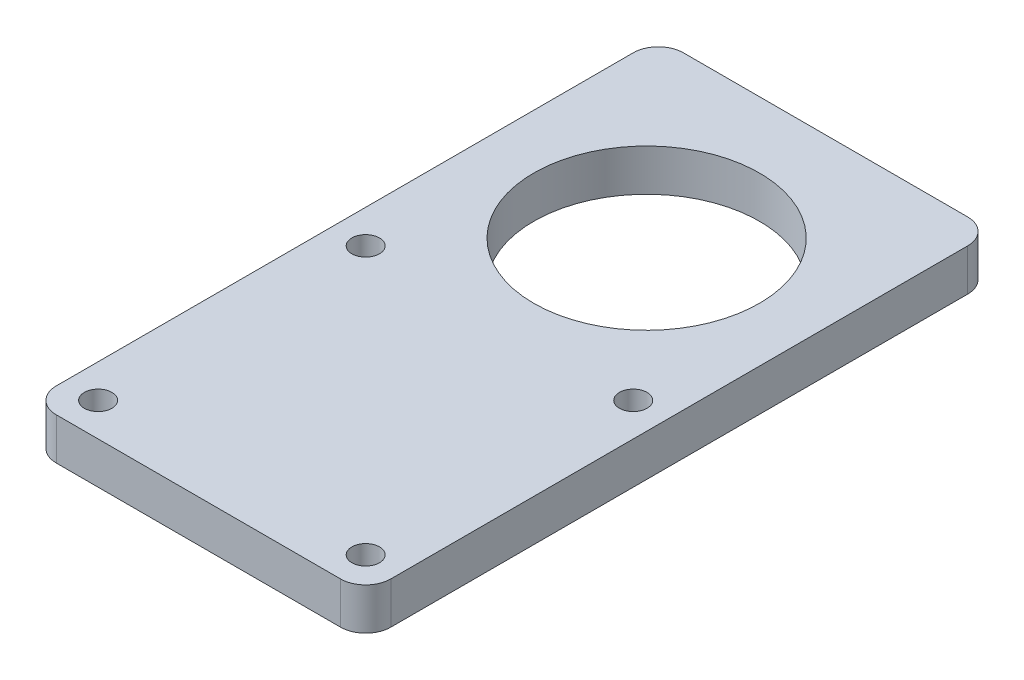
ISO-10303-21;
HEADER;
FILE_DESCRIPTION(('STEP AP214'),'2;1');
FILE_NAME('part.step','',(''),(''),'','','');
FILE_SCHEMA(('AUTOMOTIVE_DESIGN { 1 0 10303 214 1 1 1 1 }'));
ENDSEC;
DATA;
#1=APPLICATION_CONTEXT('core data for automotive mechanical design processes');
#2=APPLICATION_PROTOCOL_DEFINITION('international standard','automotive_design',2000,#1);
#3=PRODUCT_CONTEXT('',#1,'mechanical');
#4=PRODUCT('Part','Part','',(#3));
#5=PRODUCT_RELATED_PRODUCT_CATEGORY('part','',(#4));
#6=PRODUCT_DEFINITION_FORMATION('','',#4);
#7=PRODUCT_DEFINITION_CONTEXT('part definition',#1,'design');
#8=PRODUCT_DEFINITION('design','',#6,#7);
#9=PRODUCT_DEFINITION_SHAPE('','',#8);
#10=(LENGTH_UNIT() NAMED_UNIT(*) SI_UNIT(.MILLI.,.METRE.));
#11=(NAMED_UNIT(*) PLANE_ANGLE_UNIT() SI_UNIT($,.RADIAN.));
#12=(NAMED_UNIT(*) SI_UNIT($,.STERADIAN.) SOLID_ANGLE_UNIT());
#13=UNCERTAINTY_MEASURE_WITH_UNIT(LENGTH_MEASURE(1.E-05),#10,'distance_accuracy_value','');
#14=(GEOMETRIC_REPRESENTATION_CONTEXT(3) GLOBAL_UNCERTAINTY_ASSIGNED_CONTEXT((#13)) GLOBAL_UNIT_ASSIGNED_CONTEXT((#10,
#11,#12)) REPRESENTATION_CONTEXT('',''));
#15=CARTESIAN_POINT('',(0.,0.,0.));
#16=DIRECTION('',(0.,0.,1.));
#17=DIRECTION('',(1.,0.,0.));
#18=AXIS2_PLACEMENT_3D('',#15,#16,#17);
#19=CARTESIAN_POINT('',(0.,5.,0.));
#20=DIRECTION('',(0.,-1.,0.));
#21=DIRECTION('',(0.,0.,-1.));
#22=AXIS2_PLACEMENT_3D('',#19,#20,#21);
#23=PLANE('',#22);
#24=DIRECTION('',(0.,0.,1.));
#25=VECTOR('',#24,1.);
#26=CARTESIAN_POINT('',(-20.,5.,20.));
#27=LINE('',#26,#25);
#28=CARTESIAN_POINT('',(-20.,5.,-52.));
#29=VERTEX_POINT('',#28);
#30=CARTESIAN_POINT('',(-20.,5.,17.));
#31=VERTEX_POINT('',#30);
#32=EDGE_CURVE('E200',#29,#31,#27,.T.);
#33=ORIENTED_EDGE('',*,*,#32,.T.);
#34=CARTESIAN_POINT('',(-17.,5.,17.));
#35=DIRECTION('',(0.,-1.,0.));
#36=DIRECTION('',(0.,0.,-1.));
#37=AXIS2_PLACEMENT_3D('',#34,#35,#36);
#38=CIRCLE('',#37,3.);
#39=CARTESIAN_POINT('',(-17.,5.,20.));
#40=VERTEX_POINT('',#39);
#41=EDGE_CURVE('E169',#31,#40,#38,.F.);
#42=ORIENTED_EDGE('',*,*,#41,.T.);
#43=DIRECTION('',(1.,0.,0.));
#44=VECTOR('',#43,1.);
#45=CARTESIAN_POINT('',(-20.,5.,20.));
#46=LINE('',#45,#44);
#47=CARTESIAN_POINT('',(17.,5.,20.));
#48=VERTEX_POINT('',#47);
#49=EDGE_CURVE('E127',#40,#48,#46,.T.);
#50=ORIENTED_EDGE('',*,*,#49,.T.);
#51=CARTESIAN_POINT('',(17.,5.,17.));
#52=DIRECTION('',(0.,-1.,0.));
#53=DIRECTION('',(0.,0.,-1.));
#54=AXIS2_PLACEMENT_3D('',#51,#52,#53);
#55=CIRCLE('',#54,3.);
#56=CARTESIAN_POINT('',(20.,5.,17.));
#57=VERTEX_POINT('',#56);
#58=EDGE_CURVE('E161',#48,#57,#55,.F.);
#59=ORIENTED_EDGE('',*,*,#58,.T.);
#60=DIRECTION('',(0.,0.,-1.));
#61=VECTOR('',#60,1.);
#62=CARTESIAN_POINT('',(20.,5.,20.));
#63=LINE('',#62,#61);
#64=CARTESIAN_POINT('',(20.,5.,-52.));
#65=VERTEX_POINT('',#64);
#66=EDGE_CURVE('E136',#57,#65,#63,.T.);
#67=ORIENTED_EDGE('',*,*,#66,.T.);
#68=CARTESIAN_POINT('',(17.,5.,-52.));
#69=DIRECTION('',(0.,-1.,0.));
#70=DIRECTION('',(0.,0.,-1.));
#71=AXIS2_PLACEMENT_3D('',#68,#69,#70);
#72=CIRCLE('',#71,3.);
#73=CARTESIAN_POINT('',(17.,5.,-55.));
#74=VERTEX_POINT('',#73);
#75=EDGE_CURVE('E62',#65,#74,#72,.F.);
#76=ORIENTED_EDGE('',*,*,#75,.T.);
#77=DIRECTION('',(-1.,0.,0.));
#78=VECTOR('',#77,1.);
#79=CARTESIAN_POINT('',(-20.,5.,-55.));
#80=LINE('',#79,#78);
#81=CARTESIAN_POINT('',(-17.,5.,-55.));
#82=VERTEX_POINT('',#81);
#83=EDGE_CURVE('E141',#74,#82,#80,.T.);
#84=ORIENTED_EDGE('',*,*,#83,.T.);
#85=CARTESIAN_POINT('',(-17.,5.,-52.));
#86=DIRECTION('',(0.,-1.,0.));
#87=DIRECTION('',(0.,0.,-1.));
#88=AXIS2_PLACEMENT_3D('',#85,#86,#87);
#89=CIRCLE('',#88,3.);
#90=EDGE_CURVE('E164',#82,#29,#89,.F.);
#91=ORIENTED_EDGE('',*,*,#90,.T.);
#92=EDGE_LOOP('',(#33,#42,#50,#59,#67,#76,#84,#91));
#93=FACE_BOUND('',#92,.T.);
#94=CARTESIAN_POINT('',(-16.,5.,-16.));
#95=DIRECTION('',(0.,1.,0.));
#96=DIRECTION('',(0.,0.,1.));
#97=AXIS2_PLACEMENT_3D('',#94,#95,#96);
#98=CIRCLE('',#97,1.65000000000001);
#99=CARTESIAN_POINT('',(-16.,5.,-14.35));
#100=VERTEX_POINT('',#99);
#101=EDGE_CURVE('E190',#100,#100,#98,.T.);
#102=ORIENTED_EDGE('',*,*,#101,.F.);
#103=EDGE_LOOP('',(#102));
#104=FACE_BOUND('',#103,.T.);
#105=CARTESIAN_POINT('',(16.,5.,-16.));
#106=DIRECTION('',(0.,1.,0.));
#107=DIRECTION('',(0.,0.,1.));
#108=AXIS2_PLACEMENT_3D('',#105,#106,#107);
#109=CIRCLE('',#108,1.65);
#110=CARTESIAN_POINT('',(16.,5.,-14.35));
#111=VERTEX_POINT('',#110);
#112=EDGE_CURVE('E208',#111,#111,#109,.T.);
#113=ORIENTED_EDGE('',*,*,#112,.F.);
#114=EDGE_LOOP('',(#113));
#115=FACE_BOUND('',#114,.T.);
#116=CARTESIAN_POINT('',(16.,5.,16.));
#117=DIRECTION('',(0.,1.,0.));
#118=DIRECTION('',(0.,0.,1.));
#119=AXIS2_PLACEMENT_3D('',#116,#117,#118);
#120=CIRCLE('',#119,1.65);
#121=CARTESIAN_POINT('',(16.,5.,17.65));
#122=VERTEX_POINT('',#121);
#123=EDGE_CURVE('E214',#122,#122,#120,.T.);
#124=ORIENTED_EDGE('',*,*,#123,.F.);
#125=EDGE_LOOP('',(#124));
#126=FACE_BOUND('',#125,.T.);
#127=CARTESIAN_POINT('',(-16.,5.,16.));
#128=DIRECTION('',(0.,1.,0.));
#129=DIRECTION('',(0.,0.,1.));
#130=AXIS2_PLACEMENT_3D('',#127,#128,#129);
#131=CIRCLE('',#130,1.65000000000001);
#132=CARTESIAN_POINT('',(-16.,5.,17.65));
#133=VERTEX_POINT('',#132);
#134=EDGE_CURVE('E222',#133,#133,#131,.T.);
#135=ORIENTED_EDGE('',*,*,#134,.F.);
#136=EDGE_LOOP('',(#135));
#137=FACE_BOUND('',#136,.T.);
#138=CARTESIAN_POINT('',(0.,5.,-33.6));
#139=DIRECTION('',(0.,1.,0.));
#140=DIRECTION('',(0.,0.,1.));
#141=AXIS2_PLACEMENT_3D('',#138,#139,#140);
#142=CIRCLE('',#141,13.5);
#143=CARTESIAN_POINT('',(0.,5.,-20.1));
#144=VERTEX_POINT('',#143);
#145=EDGE_CURVE('E230',#144,#144,#142,.T.);
#146=ORIENTED_EDGE('',*,*,#145,.F.);
#147=EDGE_LOOP('',(#146));
#148=FACE_BOUND('',#147,.T.);
#149=ADVANCED_FACE('F39',(#93,#104,#115,#126,#137,#148),#23,.F.);
#150=CARTESIAN_POINT('',(0.,0.,0.));
#151=DIRECTION('',(0.,-1.,0.));
#152=DIRECTION('',(0.,0.,-1.));
#153=AXIS2_PLACEMENT_3D('',#150,#151,#152);
#154=PLANE('',#153);
#155=CARTESIAN_POINT('',(-16.,0.,16.));
#156=DIRECTION('',(0.,1.,0.));
#157=DIRECTION('',(0.,0.,1.));
#158=AXIS2_PLACEMENT_3D('',#155,#156,#157);
#159=CIRCLE('',#158,1.65000000000001);
#160=CARTESIAN_POINT('',(-16.,0.,17.65));
#161=VERTEX_POINT('',#160);
#162=EDGE_CURVE('E226',#161,#161,#159,.T.);
#163=ORIENTED_EDGE('',*,*,#162,.T.);
#164=EDGE_LOOP('',(#163));
#165=FACE_BOUND('',#164,.T.);
#166=CARTESIAN_POINT('',(16.,0.,-16.));
#167=DIRECTION('',(0.,1.,0.));
#168=DIRECTION('',(0.,0.,1.));
#169=AXIS2_PLACEMENT_3D('',#166,#167,#168);
#170=CIRCLE('',#169,1.65);
#171=CARTESIAN_POINT('',(16.,0.,-14.35));
#172=VERTEX_POINT('',#171);
#173=EDGE_CURVE('E210',#172,#172,#170,.T.);
#174=ORIENTED_EDGE('',*,*,#173,.T.);
#175=EDGE_LOOP('',(#174));
#176=FACE_BOUND('',#175,.T.);
#177=DIRECTION('',(1.,0.,0.));
#178=VECTOR('',#177,1.);
#179=CARTESIAN_POINT('',(-20.,0.,20.));
#180=LINE('',#179,#178);
#181=CARTESIAN_POINT('',(-17.,0.,20.));
#182=VERTEX_POINT('',#181);
#183=CARTESIAN_POINT('',(17.,0.,20.));
#184=VERTEX_POINT('',#183);
#185=EDGE_CURVE('E124',#182,#184,#180,.T.);
#186=ORIENTED_EDGE('',*,*,#185,.F.);
#187=CARTESIAN_POINT('',(-17.,0.,17.));
#188=DIRECTION('',(0.,-1.,0.));
#189=DIRECTION('',(0.,0.,-1.));
#190=AXIS2_PLACEMENT_3D('',#187,#188,#189);
#191=CIRCLE('',#190,3.);
#192=CARTESIAN_POINT('',(-20.,0.,17.));
#193=VERTEX_POINT('',#192);
#194=EDGE_CURVE('E106',#182,#193,#191,.T.);
#195=ORIENTED_EDGE('',*,*,#194,.T.);
#196=DIRECTION('',(0.,0.,1.));
#197=VECTOR('',#196,1.);
#198=CARTESIAN_POINT('',(-20.,0.,20.));
#199=LINE('',#198,#197);
#200=CARTESIAN_POINT('',(-20.,0.,-52.));
#201=VERTEX_POINT('',#200);
#202=EDGE_CURVE('E137',#201,#193,#199,.T.);
#203=ORIENTED_EDGE('',*,*,#202,.F.);
#204=CARTESIAN_POINT('',(-17.,0.,-52.));
#205=DIRECTION('',(0.,-1.,0.));
#206=DIRECTION('',(0.,0.,-1.));
#207=AXIS2_PLACEMENT_3D('',#204,#205,#206);
#208=CIRCLE('',#207,3.);
#209=CARTESIAN_POINT('',(-17.,0.,-55.));
#210=VERTEX_POINT('',#209);
#211=EDGE_CURVE('E151',#201,#210,#208,.T.);
#212=ORIENTED_EDGE('',*,*,#211,.T.);
#213=DIRECTION('',(-1.,0.,0.));
#214=VECTOR('',#213,1.);
#215=CARTESIAN_POINT('',(-20.,0.,-55.));
#216=LINE('',#215,#214);
#217=CARTESIAN_POINT('',(17.,0.,-55.));
#218=VERTEX_POINT('',#217);
#219=EDGE_CURVE('E143',#218,#210,#216,.T.);
#220=ORIENTED_EDGE('',*,*,#219,.F.);
#221=CARTESIAN_POINT('',(17.,0.,-52.));
#222=DIRECTION('',(0.,-1.,0.));
#223=DIRECTION('',(0.,0.,-1.));
#224=AXIS2_PLACEMENT_3D('',#221,#222,#223);
#225=CIRCLE('',#224,3.);
#226=CARTESIAN_POINT('',(20.,0.,-52.));
#227=VERTEX_POINT('',#226);
#228=EDGE_CURVE('E118',#218,#227,#225,.T.);
#229=ORIENTED_EDGE('',*,*,#228,.T.);
#230=DIRECTION('',(0.,0.,-1.));
#231=VECTOR('',#230,1.);
#232=CARTESIAN_POINT('',(20.,0.,20.));
#233=LINE('',#232,#231);
#234=CARTESIAN_POINT('',(20.,0.,17.));
#235=VERTEX_POINT('',#234);
#236=EDGE_CURVE('E184',#235,#227,#233,.T.);
#237=ORIENTED_EDGE('',*,*,#236,.F.);
#238=CARTESIAN_POINT('',(17.,0.,17.));
#239=DIRECTION('',(0.,-1.,0.));
#240=DIRECTION('',(0.,0.,-1.));
#241=AXIS2_PLACEMENT_3D('',#238,#239,#240);
#242=CIRCLE('',#241,3.);
#243=EDGE_CURVE('E129',#235,#184,#242,.T.);
#244=ORIENTED_EDGE('',*,*,#243,.T.);
#245=EDGE_LOOP('',(#186,#195,#203,#212,#220,#229,#237,#244));
#246=FACE_BOUND('',#245,.T.);
#247=CARTESIAN_POINT('',(-16.,0.,-16.));
#248=DIRECTION('',(0.,1.,0.));
#249=DIRECTION('',(0.,0.,1.));
#250=AXIS2_PLACEMENT_3D('',#247,#248,#249);
#251=CIRCLE('',#250,1.65000000000001);
#252=CARTESIAN_POINT('',(-16.,0.,-14.35));
#253=VERTEX_POINT('',#252);
#254=EDGE_CURVE('E195',#253,#253,#251,.T.);
#255=ORIENTED_EDGE('',*,*,#254,.T.);
#256=EDGE_LOOP('',(#255));
#257=FACE_BOUND('',#256,.T.);
#258=CARTESIAN_POINT('',(16.,0.,16.));
#259=DIRECTION('',(0.,1.,0.));
#260=DIRECTION('',(0.,0.,1.));
#261=AXIS2_PLACEMENT_3D('',#258,#259,#260);
#262=CIRCLE('',#261,1.65);
#263=CARTESIAN_POINT('',(16.,0.,17.65));
#264=VERTEX_POINT('',#263);
#265=EDGE_CURVE('E218',#264,#264,#262,.T.);
#266=ORIENTED_EDGE('',*,*,#265,.T.);
#267=EDGE_LOOP('',(#266));
#268=FACE_BOUND('',#267,.T.);
#269=CARTESIAN_POINT('',(0.,0.,-33.6));
#270=DIRECTION('',(0.,1.,0.));
#271=DIRECTION('',(0.,0.,1.));
#272=AXIS2_PLACEMENT_3D('',#269,#270,#271);
#273=CIRCLE('',#272,13.5);
#274=CARTESIAN_POINT('',(0.,0.,-20.1));
#275=VERTEX_POINT('',#274);
#276=EDGE_CURVE('E234',#275,#275,#273,.T.);
#277=ORIENTED_EDGE('',*,*,#276,.T.);
#278=EDGE_LOOP('',(#277));
#279=FACE_BOUND('',#278,.T.);
#280=ADVANCED_FACE('F132',(#165,#176,#246,#257,#268,#279),#154,.T.);
#281=CARTESIAN_POINT('',(20.,5.,20.));
#282=DIRECTION('',(-1.,0.,0.));
#283=DIRECTION('',(0.,0.,1.));
#284=AXIS2_PLACEMENT_3D('',#281,#282,#283);
#285=PLANE('',#284);
#286=ORIENTED_EDGE('',*,*,#236,.T.);
#287=DIRECTION('',(0.,-1.,0.));
#288=VECTOR('',#287,1.);
#289=CARTESIAN_POINT('',(20.,5.,-52.));
#290=LINE('',#289,#288);
#291=EDGE_CURVE('E11',#227,#65,#290,.F.);
#292=ORIENTED_EDGE('',*,*,#291,.T.);
#293=ORIENTED_EDGE('',*,*,#66,.F.);
#294=DIRECTION('',(0.,-1.,0.));
#295=VECTOR('',#294,1.);
#296=CARTESIAN_POINT('',(20.,5.,17.));
#297=LINE('',#296,#295);
#298=EDGE_CURVE('E48',#57,#235,#297,.T.);
#299=ORIENTED_EDGE('',*,*,#298,.T.);
#300=EDGE_LOOP('',(#286,#292,#293,#299));
#301=FACE_BOUND('',#300,.T.);
#302=ADVANCED_FACE('F183',(#301),#285,.F.);
#303=CARTESIAN_POINT('',(-20.,5.,-55.));
#304=DIRECTION('',(0.,0.,1.));
#305=DIRECTION('',(1.,0.,0.));
#306=AXIS2_PLACEMENT_3D('',#303,#304,#305);
#307=PLANE('',#306);
#308=ORIENTED_EDGE('',*,*,#83,.F.);
#309=DIRECTION('',(0.,-1.,0.));
#310=VECTOR('',#309,1.);
#311=CARTESIAN_POINT('',(17.,5.,-55.));
#312=LINE('',#311,#310);
#313=EDGE_CURVE('E174',#74,#218,#312,.T.);
#314=ORIENTED_EDGE('',*,*,#313,.T.);
#315=ORIENTED_EDGE('',*,*,#219,.T.);
#316=DIRECTION('',(0.,-1.,0.));
#317=VECTOR('',#316,1.);
#318=CARTESIAN_POINT('',(-17.,5.,-55.));
#319=LINE('',#318,#317);
#320=EDGE_CURVE('E55',#210,#82,#319,.F.);
#321=ORIENTED_EDGE('',*,*,#320,.T.);
#322=EDGE_LOOP('',(#308,#314,#315,#321));
#323=FACE_BOUND('',#322,.T.);
#324=ADVANCED_FACE('F262',(#323),#307,.F.);
#325=CARTESIAN_POINT('',(-20.,5.,20.));
#326=DIRECTION('',(1.,0.,0.));
#327=DIRECTION('',(0.,0.,-1.));
#328=AXIS2_PLACEMENT_3D('',#325,#326,#327);
#329=PLANE('',#328);
#330=ORIENTED_EDGE('',*,*,#202,.T.);
#331=DIRECTION('',(0.,-1.,0.));
#332=VECTOR('',#331,1.);
#333=CARTESIAN_POINT('',(-20.,5.,17.));
#334=LINE('',#333,#332);
#335=EDGE_CURVE('E111',#193,#31,#334,.F.);
#336=ORIENTED_EDGE('',*,*,#335,.T.);
#337=ORIENTED_EDGE('',*,*,#32,.F.);
#338=DIRECTION('',(0.,-1.,0.));
#339=VECTOR('',#338,1.);
#340=CARTESIAN_POINT('',(-20.,5.,-52.));
#341=LINE('',#340,#339);
#342=EDGE_CURVE('E117',#29,#201,#341,.T.);
#343=ORIENTED_EDGE('',*,*,#342,.T.);
#344=EDGE_LOOP('',(#330,#336,#337,#343));
#345=FACE_BOUND('',#344,.T.);
#346=ADVANCED_FACE('F259',(#345),#329,.F.);
#347=CARTESIAN_POINT('',(-20.,5.,20.));
#348=DIRECTION('',(0.,0.,-1.));
#349=DIRECTION('',(-1.,0.,0.));
#350=AXIS2_PLACEMENT_3D('',#347,#348,#349);
#351=PLANE('',#350);
#352=ORIENTED_EDGE('',*,*,#49,.F.);
#353=DIRECTION('',(0.,-1.,0.));
#354=VECTOR('',#353,1.);
#355=CARTESIAN_POINT('',(-17.,5.,20.));
#356=LINE('',#355,#354);
#357=EDGE_CURVE('E110',#40,#182,#356,.T.);
#358=ORIENTED_EDGE('',*,*,#357,.T.);
#359=ORIENTED_EDGE('',*,*,#185,.T.);
#360=DIRECTION('',(0.,-1.,0.));
#361=VECTOR('',#360,1.);
#362=CARTESIAN_POINT('',(17.,5.,20.));
#363=LINE('',#362,#361);
#364=EDGE_CURVE('E130',#184,#48,#363,.F.);
#365=ORIENTED_EDGE('',*,*,#364,.T.);
#366=EDGE_LOOP('',(#352,#358,#359,#365));
#367=FACE_BOUND('',#366,.T.);
#368=ADVANCED_FACE('F123',(#367),#351,.F.);
#369=CARTESIAN_POINT('',(-16.,5.,-16.));
#370=DIRECTION('',(0.,-1.,0.));
#371=DIRECTION('',(0.,0.,-1.));
#372=AXIS2_PLACEMENT_3D('',#369,#370,#371);
#373=CYLINDRICAL_SURFACE('',#372,1.65000000000001);
#374=ORIENTED_EDGE('',*,*,#101,.T.);
#375=EDGE_LOOP('',(#374));
#376=FACE_BOUND('',#375,.T.);
#377=ORIENTED_EDGE('',*,*,#254,.F.);
#378=EDGE_LOOP('',(#377));
#379=FACE_BOUND('',#378,.T.);
#380=ADVANCED_FACE('F254',(#376,#379),#373,.F.);
#381=CARTESIAN_POINT('',(16.,5.,-16.));
#382=DIRECTION('',(0.,-1.,0.));
#383=DIRECTION('',(0.,0.,-1.));
#384=AXIS2_PLACEMENT_3D('',#381,#382,#383);
#385=CYLINDRICAL_SURFACE('',#384,1.65);
#386=ORIENTED_EDGE('',*,*,#112,.T.);
#387=EDGE_LOOP('',(#386));
#388=FACE_BOUND('',#387,.T.);
#389=ORIENTED_EDGE('',*,*,#173,.F.);
#390=EDGE_LOOP('',(#389));
#391=FACE_BOUND('',#390,.T.);
#392=ADVANCED_FACE('F365',(#388,#391),#385,.F.);
#393=CARTESIAN_POINT('',(16.,5.,16.));
#394=DIRECTION('',(0.,-1.,0.));
#395=DIRECTION('',(0.,0.,-1.));
#396=AXIS2_PLACEMENT_3D('',#393,#394,#395);
#397=CYLINDRICAL_SURFACE('',#396,1.65);
#398=ORIENTED_EDGE('',*,*,#123,.T.);
#399=EDGE_LOOP('',(#398));
#400=FACE_BOUND('',#399,.T.);
#401=ORIENTED_EDGE('',*,*,#265,.F.);
#402=EDGE_LOOP('',(#401));
#403=FACE_BOUND('',#402,.T.);
#404=ADVANCED_FACE('F355',(#400,#403),#397,.F.);
#405=CARTESIAN_POINT('',(-16.,5.,16.));
#406=DIRECTION('',(0.,-1.,0.));
#407=DIRECTION('',(0.,0.,-1.));
#408=AXIS2_PLACEMENT_3D('',#405,#406,#407);
#409=CYLINDRICAL_SURFACE('',#408,1.65000000000001);
#410=ORIENTED_EDGE('',*,*,#134,.T.);
#411=EDGE_LOOP('',(#410));
#412=FACE_BOUND('',#411,.T.);
#413=ORIENTED_EDGE('',*,*,#162,.F.);
#414=EDGE_LOOP('',(#413));
#415=FACE_BOUND('',#414,.T.);
#416=ADVANCED_FACE('F346',(#412,#415),#409,.F.);
#417=CARTESIAN_POINT('',(0.,5.,-33.6));
#418=DIRECTION('',(0.,-1.,0.));
#419=DIRECTION('',(0.,0.,-1.));
#420=AXIS2_PLACEMENT_3D('',#417,#418,#419);
#421=CYLINDRICAL_SURFACE('',#420,13.5);
#422=ORIENTED_EDGE('',*,*,#145,.T.);
#423=EDGE_LOOP('',(#422));
#424=FACE_BOUND('',#423,.T.);
#425=ORIENTED_EDGE('',*,*,#276,.F.);
#426=EDGE_LOOP('',(#425));
#427=FACE_BOUND('',#426,.T.);
#428=ADVANCED_FACE('F242',(#424,#427),#421,.F.);
#429=CARTESIAN_POINT('',(-17.,5.,17.));
#430=DIRECTION('',(0.,-1.,0.));
#431=DIRECTION('',(0.,0.,-1.));
#432=AXIS2_PLACEMENT_3D('',#429,#430,#431);
#433=CYLINDRICAL_SURFACE('',#432,3.);
#434=ORIENTED_EDGE('',*,*,#41,.F.);
#435=ORIENTED_EDGE('',*,*,#335,.F.);
#436=ORIENTED_EDGE('',*,*,#194,.F.);
#437=ORIENTED_EDGE('',*,*,#357,.F.);
#438=EDGE_LOOP('',(#434,#435,#436,#437));
#439=FACE_BOUND('',#438,.T.);
#440=ADVANCED_FACE('F109',(#439),#433,.T.);
#441=CARTESIAN_POINT('',(17.,5.,-52.));
#442=DIRECTION('',(0.,-1.,0.));
#443=DIRECTION('',(0.,0.,-1.));
#444=AXIS2_PLACEMENT_3D('',#441,#442,#443);
#445=CYLINDRICAL_SURFACE('',#444,3.);
#446=ORIENTED_EDGE('',*,*,#75,.F.);
#447=ORIENTED_EDGE('',*,*,#291,.F.);
#448=ORIENTED_EDGE('',*,*,#228,.F.);
#449=ORIENTED_EDGE('',*,*,#313,.F.);
#450=EDGE_LOOP('',(#446,#447,#448,#449));
#451=FACE_BOUND('',#450,.T.);
#452=ADVANCED_FACE('F270',(#451),#445,.T.);
#453=CARTESIAN_POINT('',(-17.,5.,-52.));
#454=DIRECTION('',(0.,-1.,0.));
#455=DIRECTION('',(0.,0.,-1.));
#456=AXIS2_PLACEMENT_3D('',#453,#454,#455);
#457=CYLINDRICAL_SURFACE('',#456,3.);
#458=ORIENTED_EDGE('',*,*,#90,.F.);
#459=ORIENTED_EDGE('',*,*,#320,.F.);
#460=ORIENTED_EDGE('',*,*,#211,.F.);
#461=ORIENTED_EDGE('',*,*,#342,.F.);
#462=EDGE_LOOP('',(#458,#459,#460,#461));
#463=FACE_BOUND('',#462,.T.);
#464=ADVANCED_FACE('F272',(#463),#457,.T.);
#465=CARTESIAN_POINT('',(17.,5.,17.));
#466=DIRECTION('',(0.,-1.,0.));
#467=DIRECTION('',(0.,0.,-1.));
#468=AXIS2_PLACEMENT_3D('',#465,#466,#467);
#469=CYLINDRICAL_SURFACE('',#468,3.);
#470=ORIENTED_EDGE('',*,*,#58,.F.);
#471=ORIENTED_EDGE('',*,*,#364,.F.);
#472=ORIENTED_EDGE('',*,*,#243,.F.);
#473=ORIENTED_EDGE('',*,*,#298,.F.);
#474=EDGE_LOOP('',(#470,#471,#472,#473));
#475=FACE_BOUND('',#474,.T.);
#476=ADVANCED_FACE('F41',(#475),#469,.T.);
#477=CLOSED_SHELL('',(#149,#280,#302,#324,#346,#368,#380,#392,#404,#416,#428,#440,#452,#464,#476));
#478=MANIFOLD_SOLID_BREP('B2',#477);
#479=ADVANCED_BREP_SHAPE_REPRESENTATION('',(#18,#478),#14);
#480=SHAPE_DEFINITION_REPRESENTATION(#9,#479);
ENDSEC;
END-ISO-10303-21;
